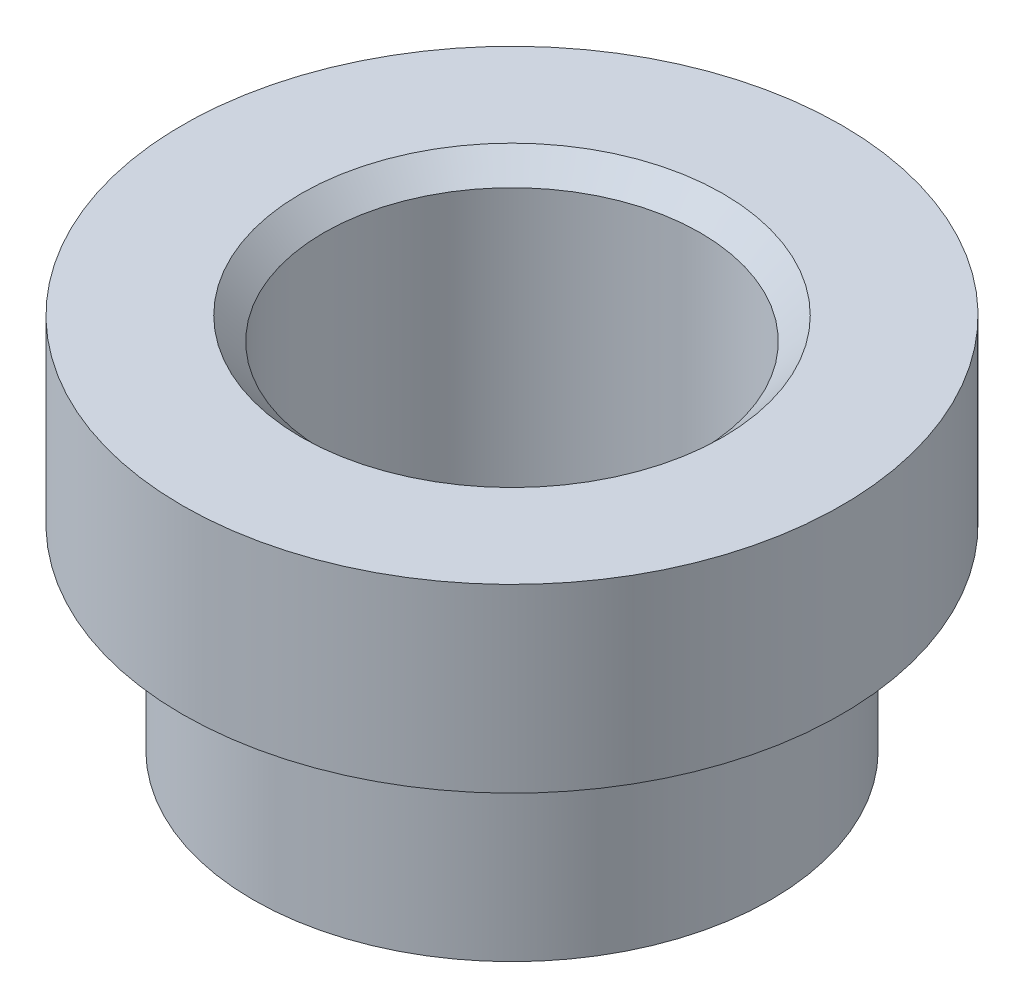
ISO-10303-21;
HEADER;
FILE_DESCRIPTION(('STEP AP214'),'2;1');
FILE_NAME('part.step','',(''),(''),'','','');
FILE_SCHEMA(('AUTOMOTIVE_DESIGN { 1 0 10303 214 1 1 1 1 }'));
ENDSEC;
DATA;
#1=APPLICATION_CONTEXT('core data for automotive mechanical design processes');
#2=APPLICATION_PROTOCOL_DEFINITION('international standard','automotive_design',2000,#1);
#3=PRODUCT_CONTEXT('',#1,'mechanical');
#4=PRODUCT('Part','Part','',(#3));
#5=PRODUCT_RELATED_PRODUCT_CATEGORY('part','',(#4));
#6=PRODUCT_DEFINITION_FORMATION('','',#4);
#7=PRODUCT_DEFINITION_CONTEXT('part definition',#1,'design');
#8=PRODUCT_DEFINITION('design','',#6,#7);
#9=PRODUCT_DEFINITION_SHAPE('','',#8);
#10=(LENGTH_UNIT() NAMED_UNIT(*) SI_UNIT(.MILLI.,.METRE.));
#11=(NAMED_UNIT(*) PLANE_ANGLE_UNIT() SI_UNIT($,.RADIAN.));
#12=(NAMED_UNIT(*) SI_UNIT($,.STERADIAN.) SOLID_ANGLE_UNIT());
#13=UNCERTAINTY_MEASURE_WITH_UNIT(LENGTH_MEASURE(1.E-05),#10,'distance_accuracy_value','');
#14=(GEOMETRIC_REPRESENTATION_CONTEXT(3) GLOBAL_UNCERTAINTY_ASSIGNED_CONTEXT((#13)) GLOBAL_UNIT_ASSIGNED_CONTEXT((#10,
#11,#12)) REPRESENTATION_CONTEXT('',''));
#15=CARTESIAN_POINT('',(0.,0.,0.));
#16=DIRECTION('',(0.,0.,1.));
#17=DIRECTION('',(1.,0.,0.));
#18=AXIS2_PLACEMENT_3D('',#15,#16,#17);
#19=CARTESIAN_POINT('',(0.,0.,0.));
#20=DIRECTION('',(0.,1.,0.));
#21=DIRECTION('',(0.,0.,1.));
#22=AXIS2_PLACEMENT_3D('',#19,#20,#21);
#23=CYLINDRICAL_SURFACE('',#22,8.73125);
#24=CARTESIAN_POINT('',(0.,0.,0.));
#25=DIRECTION('',(0.,1.,0.));
#26=DIRECTION('',(0.,0.,1.));
#27=AXIS2_PLACEMENT_3D('',#24,#25,#26);
#28=CIRCLE('',#27,8.73125);
#29=CARTESIAN_POINT('',(0.,0.,8.73125));
#30=VERTEX_POINT('',#29);
#31=EDGE_CURVE('E59',#30,#30,#28,.T.);
#32=ORIENTED_EDGE('',*,*,#31,.F.);
#33=EDGE_LOOP('',(#32));
#34=FACE_BOUND('',#33,.T.);
#35=CARTESIAN_POINT('',(0.,-6.604,0.));
#36=DIRECTION('',(0.,1.,0.));
#37=DIRECTION('',(0.,0.,1.));
#38=AXIS2_PLACEMENT_3D('',#35,#36,#37);
#39=CIRCLE('',#38,8.73125);
#40=CARTESIAN_POINT('',(0.,-6.604,8.73125));
#41=VERTEX_POINT('',#40);
#42=EDGE_CURVE('E44',#41,#41,#39,.T.);
#43=ORIENTED_EDGE('',*,*,#42,.T.);
#44=EDGE_LOOP('',(#43));
#45=FACE_BOUND('',#44,.T.);
#46=ADVANCED_FACE('F33',(#34,#45),#23,.T.);
#47=CARTESIAN_POINT('',(6.35,-6.604,0.));
#48=DIRECTION('',(0.,1.,0.));
#49=DIRECTION('',(0.,0.,1.));
#50=AXIS2_PLACEMENT_3D('',#47,#48,#49);
#51=PLANE('',#50);
#52=ORIENTED_EDGE('',*,*,#42,.F.);
#53=EDGE_LOOP('',(#52));
#54=FACE_BOUND('',#53,.T.);
#55=CARTESIAN_POINT('',(0.,-6.604,0.));
#56=DIRECTION('',(0.,1.,0.));
#57=DIRECTION('',(0.,0.,1.));
#58=AXIS2_PLACEMENT_3D('',#55,#56,#57);
#59=CIRCLE('',#58,6.35);
#60=CARTESIAN_POINT('',(0.,-6.604,6.35));
#61=VERTEX_POINT('',#60);
#62=EDGE_CURVE('E48',#61,#61,#59,.T.);
#63=ORIENTED_EDGE('',*,*,#62,.T.);
#64=EDGE_LOOP('',(#63));
#65=FACE_BOUND('',#64,.T.);
#66=ADVANCED_FACE('F67',(#54,#65),#51,.F.);
#67=CARTESIAN_POINT('',(0.,0.,0.));
#68=DIRECTION('',(0.,1.,0.));
#69=DIRECTION('',(0.,0.,1.));
#70=AXIS2_PLACEMENT_3D('',#67,#68,#69);
#71=CYLINDRICAL_SURFACE('',#70,6.35);
#72=CARTESIAN_POINT('',(0.,5.33400000000001,0.));
#73=DIRECTION('',(0.,-1.,0.));
#74=DIRECTION('',(0.,0.,-1.));
#75=AXIS2_PLACEMENT_3D('',#72,#73,#74);
#76=CIRCLE('',#75,6.35);
#77=CARTESIAN_POINT('',(0.,5.33400000000001,-6.35));
#78=VERTEX_POINT('',#77);
#79=EDGE_CURVE('E40',#78,#78,#76,.F.);
#80=ORIENTED_EDGE('',*,*,#79,.T.);
#81=EDGE_LOOP('',(#80));
#82=FACE_BOUND('',#81,.T.);
#83=ORIENTED_EDGE('',*,*,#62,.F.);
#84=EDGE_LOOP('',(#83));
#85=FACE_BOUND('',#84,.T.);
#86=ADVANCED_FACE('F72',(#82,#85),#71,.F.);
#87=CARTESIAN_POINT('',(11.1125,6.096,0.));
#88=DIRECTION('',(0.,-1.,0.));
#89=DIRECTION('',(0.,0.,-1.));
#90=AXIS2_PLACEMENT_3D('',#87,#88,#89);
#91=PLANE('',#90);
#92=CARTESIAN_POINT('',(0.,6.096,0.));
#93=DIRECTION('',(0.,-1.,0.));
#94=DIRECTION('',(0.,0.,-1.));
#95=AXIS2_PLACEMENT_3D('',#92,#93,#94);
#96=CIRCLE('',#95,7.112);
#97=CARTESIAN_POINT('',(0.,6.096,-7.112));
#98=VERTEX_POINT('',#97);
#99=EDGE_CURVE('E10',#98,#98,#96,.T.);
#100=ORIENTED_EDGE('',*,*,#99,.T.);
#101=EDGE_LOOP('',(#100));
#102=FACE_BOUND('',#101,.T.);
#103=CARTESIAN_POINT('',(0.,6.096,0.));
#104=DIRECTION('',(0.,1.,0.));
#105=DIRECTION('',(0.,0.,1.));
#106=AXIS2_PLACEMENT_3D('',#103,#104,#105);
#107=CIRCLE('',#106,11.1125);
#108=CARTESIAN_POINT('',(0.,6.096,11.1125));
#109=VERTEX_POINT('',#108);
#110=EDGE_CURVE('E53',#109,#109,#107,.T.);
#111=ORIENTED_EDGE('',*,*,#110,.T.);
#112=EDGE_LOOP('',(#111));
#113=FACE_BOUND('',#112,.T.);
#114=ADVANCED_FACE('F77',(#102,#113),#91,.F.);
#115=CARTESIAN_POINT('',(0.,0.,0.));
#116=DIRECTION('',(0.,1.,0.));
#117=DIRECTION('',(0.,0.,1.));
#118=AXIS2_PLACEMENT_3D('',#115,#116,#117);
#119=CYLINDRICAL_SURFACE('',#118,11.1125);
#120=ORIENTED_EDGE('',*,*,#110,.F.);
#121=EDGE_LOOP('',(#120));
#122=FACE_BOUND('',#121,.T.);
#123=CARTESIAN_POINT('',(0.,0.,0.));
#124=DIRECTION('',(0.,1.,0.));
#125=DIRECTION('',(0.,0.,1.));
#126=AXIS2_PLACEMENT_3D('',#123,#124,#125);
#127=CIRCLE('',#126,11.1125);
#128=CARTESIAN_POINT('',(0.,0.,11.1125));
#129=VERTEX_POINT('',#128);
#130=EDGE_CURVE('E56',#129,#129,#127,.T.);
#131=ORIENTED_EDGE('',*,*,#130,.T.);
#132=EDGE_LOOP('',(#131));
#133=FACE_BOUND('',#132,.T.);
#134=ADVANCED_FACE('F82',(#122,#133),#119,.T.);
#135=CARTESIAN_POINT('',(8.73125,0.,0.));
#136=DIRECTION('',(0.,1.,0.));
#137=DIRECTION('',(0.,0.,1.));
#138=AXIS2_PLACEMENT_3D('',#135,#136,#137);
#139=PLANE('',#138);
#140=ORIENTED_EDGE('',*,*,#130,.F.);
#141=EDGE_LOOP('',(#140));
#142=FACE_BOUND('',#141,.T.);
#143=ORIENTED_EDGE('',*,*,#31,.T.);
#144=EDGE_LOOP('',(#143));
#145=FACE_BOUND('',#144,.T.);
#146=ADVANCED_FACE('F63',(#142,#145),#139,.F.);
#147=CARTESIAN_POINT('',(0.,5.33400000000001,0.));
#148=DIRECTION('',(0.,1.,0.));
#149=DIRECTION('',(0.,0.,1.));
#150=AXIS2_PLACEMENT_3D('',#147,#148,#149);
#151=CONICAL_SURFACE('',#150,6.35,0.785398163397452);
#152=ORIENTED_EDGE('',*,*,#99,.F.);
#153=EDGE_LOOP('',(#152));
#154=FACE_BOUND('',#153,.T.);
#155=ORIENTED_EDGE('',*,*,#79,.F.);
#156=EDGE_LOOP('',(#155));
#157=FACE_BOUND('',#156,.T.);
#158=ADVANCED_FACE('F35',(#154,#157),#151,.F.);
#159=CLOSED_SHELL('',(#46,#66,#86,#114,#134,#146,#158));
#160=MANIFOLD_SOLID_BREP('B2',#159);
#161=ADVANCED_BREP_SHAPE_REPRESENTATION('',(#18,#160),#14);
#162=SHAPE_DEFINITION_REPRESENTATION(#9,#161);
ENDSEC;
END-ISO-10303-21;
